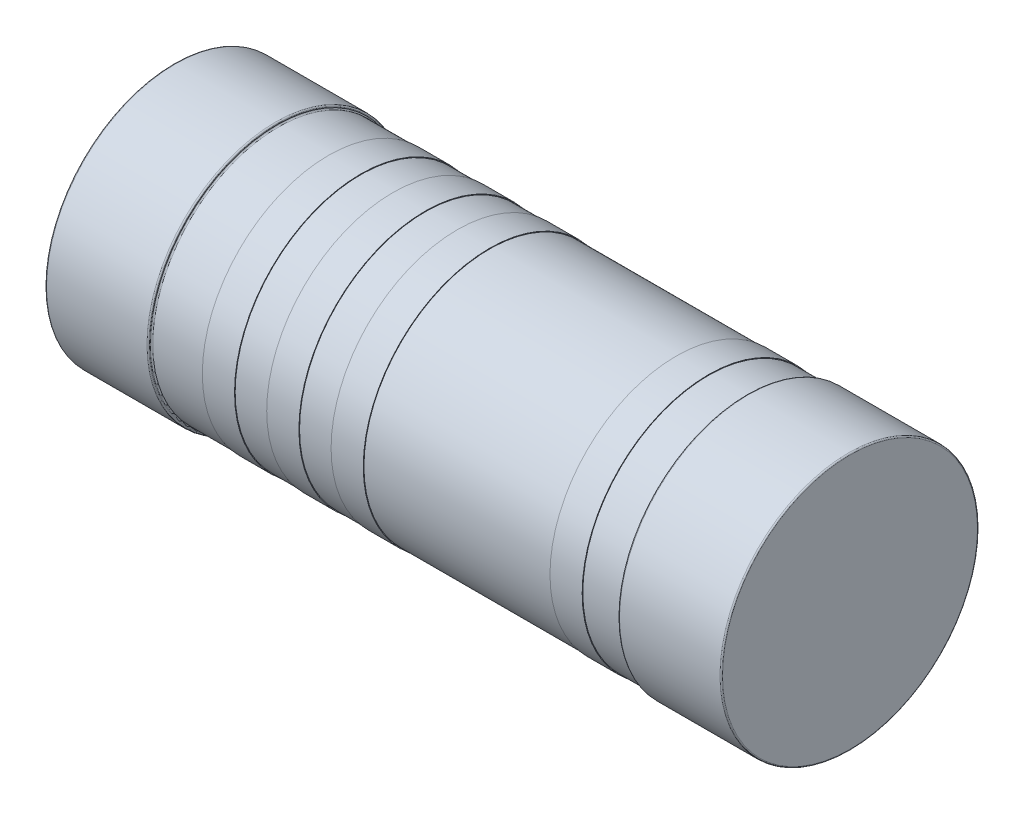
ISO-10303-21;
HEADER;
FILE_DESCRIPTION(('STEP AP214'),'2;1');
FILE_NAME('part.step','',(''),(''),'','','');
FILE_SCHEMA(('AUTOMOTIVE_DESIGN { 1 0 10303 214 1 1 1 1 }'));
ENDSEC;
DATA;
#1=APPLICATION_CONTEXT('core data for automotive mechanical design processes');
#2=APPLICATION_PROTOCOL_DEFINITION('international standard','automotive_design',2000,#1);
#3=PRODUCT_CONTEXT('',#1,'mechanical');
#4=PRODUCT('Part','Part','',(#3));
#5=PRODUCT_RELATED_PRODUCT_CATEGORY('part','',(#4));
#6=PRODUCT_DEFINITION_FORMATION('','',#4);
#7=PRODUCT_DEFINITION_CONTEXT('part definition',#1,'design');
#8=PRODUCT_DEFINITION('design','',#6,#7);
#9=PRODUCT_DEFINITION_SHAPE('','',#8);
#10=(LENGTH_UNIT() NAMED_UNIT(*) SI_UNIT(.MILLI.,.METRE.));
#11=(NAMED_UNIT(*) PLANE_ANGLE_UNIT() SI_UNIT($,.RADIAN.));
#12=(NAMED_UNIT(*) SI_UNIT($,.STERADIAN.) SOLID_ANGLE_UNIT());
#13=UNCERTAINTY_MEASURE_WITH_UNIT(LENGTH_MEASURE(1.E-05),#10,'distance_accuracy_value','');
#14=(GEOMETRIC_REPRESENTATION_CONTEXT(3) GLOBAL_UNCERTAINTY_ASSIGNED_CONTEXT((#13)) GLOBAL_UNIT_ASSIGNED_CONTEXT((#10,
#11,#12)) REPRESENTATION_CONTEXT('',''));
#15=CARTESIAN_POINT('',(0.,0.,0.));
#16=DIRECTION('',(0.,0.,1.));
#17=DIRECTION('',(1.,0.,0.));
#18=AXIS2_PLACEMENT_3D('',#15,#16,#17);
#19=CARTESIAN_POINT('',(-5.25,0.0200000000000001,0.));
#20=DIRECTION('',(-1.,0.,0.));
#21=DIRECTION('',(0.,0.,1.));
#22=AXIS2_PLACEMENT_3D('',#19,#20,#21);
#23=PLANE('',#22);
#24=CARTESIAN_POINT('',(-5.25,2.,0.));
#25=DIRECTION('',(-1.,0.,0.));
#26=DIRECTION('',(0.,0.,1.));
#27=AXIS2_PLACEMENT_3D('',#24,#25,#26);
#28=CIRCLE('',#27,1.98);
#29=CARTESIAN_POINT('',(-5.25,2.,1.98));
#30=VERTEX_POINT('',#29);
#31=EDGE_CURVE('E121',#30,#30,#28,.T.);
#32=ORIENTED_EDGE('',*,*,#31,.T.);
#33=EDGE_LOOP('',(#32));
#34=FACE_BOUND('',#33,.T.);
#35=ADVANCED_FACE('F33',(#34),#23,.T.);
#36=CARTESIAN_POINT('',(5.25,2.,0.));
#37=DIRECTION('',(1.,0.,0.));
#38=DIRECTION('',(0.,0.,-1.));
#39=AXIS2_PLACEMENT_3D('',#36,#37,#38);
#40=PLANE('',#39);
#41=CARTESIAN_POINT('',(5.25,2.,0.));
#42=DIRECTION('',(-1.,0.,0.));
#43=DIRECTION('',(0.,0.,1.));
#44=AXIS2_PLACEMENT_3D('',#41,#42,#43);
#45=CIRCLE('',#44,1.98);
#46=CARTESIAN_POINT('',(5.25,2.,1.98));
#47=VERTEX_POINT('',#46);
#48=EDGE_CURVE('E10',#47,#47,#45,.T.);
#49=ORIENTED_EDGE('',*,*,#48,.F.);
#50=EDGE_LOOP('',(#49));
#51=FACE_BOUND('',#50,.T.);
#52=ADVANCED_FACE('F138',(#51),#40,.T.);
#53=CARTESIAN_POINT('',(5.23,2.,0.));
#54=DIRECTION('',(-1.,0.,0.));
#55=DIRECTION('',(0.,0.,1.));
#56=AXIS2_PLACEMENT_3D('',#53,#54,#55);
#57=TOROIDAL_SURFACE('',#56,1.98,0.0200000000000005);
#58=ORIENTED_EDGE('',*,*,#48,.T.);
#59=EDGE_LOOP('',(#58));
#60=FACE_BOUND('',#59,.T.);
#61=CARTESIAN_POINT('',(5.23,2.,0.));
#62=DIRECTION('',(-1.,0.,0.));
#63=DIRECTION('',(0.,0.,1.));
#64=AXIS2_PLACEMENT_3D('',#61,#62,#63);
#65=CIRCLE('',#64,2.);
#66=CARTESIAN_POINT('',(5.23,2.,2.));
#67=VERTEX_POINT('',#66);
#68=EDGE_CURVE('E39',#67,#67,#65,.T.);
#69=ORIENTED_EDGE('',*,*,#68,.F.);
#70=EDGE_LOOP('',(#69));
#71=FACE_BOUND('',#70,.T.);
#72=ADVANCED_FACE('F142',(#60,#71),#57,.T.);
#73=CARTESIAN_POINT('',(-5.25,2.,0.));
#74=DIRECTION('',(-1.,0.,0.));
#75=DIRECTION('',(0.,0.,1.));
#76=AXIS2_PLACEMENT_3D('',#73,#74,#75);
#77=CYLINDRICAL_SURFACE('',#76,2.);
#78=ORIENTED_EDGE('',*,*,#68,.T.);
#79=EDGE_LOOP('',(#78));
#80=FACE_BOUND('',#79,.T.);
#81=CARTESIAN_POINT('',(3.67,2.,0.));
#82=DIRECTION('',(-1.,0.,0.));
#83=DIRECTION('',(0.,0.,1.));
#84=AXIS2_PLACEMENT_3D('',#81,#82,#83);
#85=CIRCLE('',#84,2.);
#86=CARTESIAN_POINT('',(3.67,2.,2.));
#87=VERTEX_POINT('',#86);
#88=EDGE_CURVE('E43',#87,#87,#85,.T.);
#89=ORIENTED_EDGE('',*,*,#88,.F.);
#90=EDGE_LOOP('',(#89));
#91=FACE_BOUND('',#90,.T.);
#92=ADVANCED_FACE('F147',(#80,#91),#77,.T.);
#93=CARTESIAN_POINT('',(3.67,2.,0.));
#94=DIRECTION('',(-1.,0.,0.));
#95=DIRECTION('',(0.,0.,1.));
#96=AXIS2_PLACEMENT_3D('',#93,#94,#95);
#97=TOROIDAL_SURFACE('',#96,1.98,0.02);
#98=ORIENTED_EDGE('',*,*,#88,.T.);
#99=EDGE_LOOP('',(#98));
#100=FACE_BOUND('',#99,.T.);
#101=CARTESIAN_POINT('',(3.65,2.,0.));
#102=DIRECTION('',(-1.,0.,0.));
#103=DIRECTION('',(0.,0.,1.));
#104=AXIS2_PLACEMENT_3D('',#101,#102,#103);
#105=CIRCLE('',#104,1.98);
#106=CARTESIAN_POINT('',(3.65,2.,1.98));
#107=VERTEX_POINT('',#106);
#108=EDGE_CURVE('E47',#107,#107,#105,.T.);
#109=ORIENTED_EDGE('',*,*,#108,.F.);
#110=EDGE_LOOP('',(#109));
#111=FACE_BOUND('',#110,.T.);
#112=ADVANCED_FACE('F152',(#100,#111),#97,.T.);
#113=CARTESIAN_POINT('',(3.65,0.03,0.));
#114=DIRECTION('',(-1.,0.,0.));
#115=DIRECTION('',(0.,0.,1.));
#116=AXIS2_PLACEMENT_3D('',#113,#114,#115);
#117=PLANE('',#116);
#118=ORIENTED_EDGE('',*,*,#108,.T.);
#119=EDGE_LOOP('',(#118));
#120=FACE_BOUND('',#119,.T.);
#121=CARTESIAN_POINT('',(3.65,2.,0.));
#122=DIRECTION('',(-1.,0.,0.));
#123=DIRECTION('',(0.,0.,1.));
#124=AXIS2_PLACEMENT_3D('',#121,#122,#123);
#125=CIRCLE('',#124,1.97);
#126=CARTESIAN_POINT('',(3.65,2.,1.97));
#127=VERTEX_POINT('',#126);
#128=EDGE_CURVE('E52',#127,#127,#125,.T.);
#129=ORIENTED_EDGE('',*,*,#128,.F.);
#130=EDGE_LOOP('',(#129));
#131=FACE_BOUND('',#130,.T.);
#132=ADVANCED_FACE('F155',(#120,#131),#117,.T.);
#133=CARTESIAN_POINT('',(3.63,2.,0.));
#134=DIRECTION('',(-1.,0.,0.));
#135=DIRECTION('',(0.,0.,1.));
#136=AXIS2_PLACEMENT_3D('',#133,#134,#135);
#137=TOROIDAL_SURFACE('',#136,1.97,0.02);
#138=ORIENTED_EDGE('',*,*,#128,.T.);
#139=EDGE_LOOP('',(#138));
#140=FACE_BOUND('',#139,.T.);
#141=CARTESIAN_POINT('',(3.63,2.,0.));
#142=DIRECTION('',(-1.,0.,0.));
#143=DIRECTION('',(0.,0.,1.));
#144=AXIS2_PLACEMENT_3D('',#141,#142,#143);
#145=CIRCLE('',#144,1.95);
#146=CARTESIAN_POINT('',(3.63,2.,1.95));
#147=VERTEX_POINT('',#146);
#148=EDGE_CURVE('E55',#147,#147,#145,.T.);
#149=ORIENTED_EDGE('',*,*,#148,.F.);
#150=EDGE_LOOP('',(#149));
#151=FACE_BOUND('',#150,.T.);
#152=ADVANCED_FACE('F159',(#140,#151),#137,.F.);
#153=CARTESIAN_POINT('',(-5.25,2.,0.));
#154=DIRECTION('',(-1.,0.,0.));
#155=DIRECTION('',(0.,0.,1.));
#156=AXIS2_PLACEMENT_3D('',#153,#154,#155);
#157=CYLINDRICAL_SURFACE('',#156,1.95);
#158=ORIENTED_EDGE('',*,*,#148,.T.);
#159=EDGE_LOOP('',(#158));
#160=FACE_BOUND('',#159,.T.);
#161=CARTESIAN_POINT('',(3.05,2.,0.));
#162=DIRECTION('',(-1.,0.,0.));
#163=DIRECTION('',(0.,0.,1.));
#164=AXIS2_PLACEMENT_3D('',#161,#162,#163);
#165=CIRCLE('',#164,1.95);
#166=CARTESIAN_POINT('',(3.05,2.,1.95));
#167=VERTEX_POINT('',#166);
#168=EDGE_CURVE('E58',#167,#167,#165,.T.);
#169=ORIENTED_EDGE('',*,*,#168,.F.);
#170=EDGE_LOOP('',(#169));
#171=FACE_BOUND('',#170,.T.);
#172=ADVANCED_FACE('F163',(#160,#171),#157,.T.);
#173=CARTESIAN_POINT('',(3.05,0.05,0.));
#174=DIRECTION('',(1.,0.,0.));
#175=DIRECTION('',(0.,0.,-1.));
#176=AXIS2_PLACEMENT_3D('',#173,#174,#175);
#177=PLANE('',#176);
#178=ORIENTED_EDGE('',*,*,#168,.T.);
#179=EDGE_LOOP('',(#178));
#180=FACE_BOUND('',#179,.T.);
#181=CARTESIAN_POINT('',(3.05,2.,0.));
#182=DIRECTION('',(-1.,0.,0.));
#183=DIRECTION('',(0.,0.,1.));
#184=AXIS2_PLACEMENT_3D('',#181,#182,#183);
#185=CIRCLE('',#184,1.96);
#186=CARTESIAN_POINT('',(3.05,2.,1.96));
#187=VERTEX_POINT('',#186);
#188=EDGE_CURVE('E61',#187,#187,#185,.T.);
#189=ORIENTED_EDGE('',*,*,#188,.F.);
#190=EDGE_LOOP('',(#189));
#191=FACE_BOUND('',#190,.T.);
#192=ADVANCED_FACE('F167',(#180,#191),#177,.T.);
#193=CARTESIAN_POINT('',(-5.25,2.,0.));
#194=DIRECTION('',(-1.,0.,0.));
#195=DIRECTION('',(0.,0.,1.));
#196=AXIS2_PLACEMENT_3D('',#193,#194,#195);
#197=CYLINDRICAL_SURFACE('',#196,1.96);
#198=ORIENTED_EDGE('',*,*,#188,.T.);
#199=EDGE_LOOP('',(#198));
#200=FACE_BOUND('',#199,.T.);
#201=CARTESIAN_POINT('',(2.55,2.,0.));
#202=DIRECTION('',(-1.,0.,0.));
#203=DIRECTION('',(0.,0.,1.));
#204=AXIS2_PLACEMENT_3D('',#201,#202,#203);
#205=CIRCLE('',#204,1.96);
#206=CARTESIAN_POINT('',(2.55,2.,1.96));
#207=VERTEX_POINT('',#206);
#208=EDGE_CURVE('E64',#207,#207,#205,.T.);
#209=ORIENTED_EDGE('',*,*,#208,.F.);
#210=EDGE_LOOP('',(#209));
#211=FACE_BOUND('',#210,.T.);
#212=ADVANCED_FACE('F171',(#200,#211),#197,.T.);
#213=CARTESIAN_POINT('',(2.55,0.0400000000000004,0.));
#214=DIRECTION('',(-1.,0.,0.));
#215=DIRECTION('',(0.,0.,1.));
#216=AXIS2_PLACEMENT_3D('',#213,#214,#215);
#217=PLANE('',#216);
#218=ORIENTED_EDGE('',*,*,#208,.T.);
#219=EDGE_LOOP('',(#218));
#220=FACE_BOUND('',#219,.T.);
#221=CARTESIAN_POINT('',(2.55,2.,0.));
#222=DIRECTION('',(-1.,0.,0.));
#223=DIRECTION('',(0.,0.,1.));
#224=AXIS2_PLACEMENT_3D('',#221,#222,#223);
#225=CIRCLE('',#224,1.95);
#226=CARTESIAN_POINT('',(2.55,2.,1.95));
#227=VERTEX_POINT('',#226);
#228=EDGE_CURVE('E67',#227,#227,#225,.T.);
#229=ORIENTED_EDGE('',*,*,#228,.F.);
#230=EDGE_LOOP('',(#229));
#231=FACE_BOUND('',#230,.T.);
#232=ADVANCED_FACE('F175',(#220,#231),#217,.T.);
#233=CARTESIAN_POINT('',(-5.25,2.,0.));
#234=DIRECTION('',(-1.,0.,0.));
#235=DIRECTION('',(0.,0.,1.));
#236=AXIS2_PLACEMENT_3D('',#233,#234,#235);
#237=CYLINDRICAL_SURFACE('',#236,1.95);
#238=ORIENTED_EDGE('',*,*,#228,.T.);
#239=EDGE_LOOP('',(#238));
#240=FACE_BOUND('',#239,.T.);
#241=CARTESIAN_POINT('',(-0.35,2.,0.));
#242=DIRECTION('',(-1.,0.,0.));
#243=DIRECTION('',(0.,0.,1.));
#244=AXIS2_PLACEMENT_3D('',#241,#242,#243);
#245=CIRCLE('',#244,1.95);
#246=CARTESIAN_POINT('',(-0.35,2.,1.95));
#247=VERTEX_POINT('',#246);
#248=EDGE_CURVE('E70',#247,#247,#245,.T.);
#249=ORIENTED_EDGE('',*,*,#248,.F.);
#250=EDGE_LOOP('',(#249));
#251=FACE_BOUND('',#250,.T.);
#252=ADVANCED_FACE('F179',(#240,#251),#237,.T.);
#253=CARTESIAN_POINT('',(-0.35,0.04,0.));
#254=DIRECTION('',(1.,0.,0.));
#255=DIRECTION('',(0.,0.,-1.));
#256=AXIS2_PLACEMENT_3D('',#253,#254,#255);
#257=PLANE('',#256);
#258=ORIENTED_EDGE('',*,*,#248,.T.);
#259=EDGE_LOOP('',(#258));
#260=FACE_BOUND('',#259,.T.);
#261=CARTESIAN_POINT('',(-0.35,2.,0.));
#262=DIRECTION('',(-1.,0.,0.));
#263=DIRECTION('',(0.,0.,1.));
#264=AXIS2_PLACEMENT_3D('',#261,#262,#263);
#265=CIRCLE('',#264,1.96);
#266=CARTESIAN_POINT('',(-0.35,2.,1.96));
#267=VERTEX_POINT('',#266);
#268=EDGE_CURVE('E73',#267,#267,#265,.T.);
#269=ORIENTED_EDGE('',*,*,#268,.F.);
#270=EDGE_LOOP('',(#269));
#271=FACE_BOUND('',#270,.T.);
#272=ADVANCED_FACE('F183',(#260,#271),#257,.T.);
#273=CARTESIAN_POINT('',(-5.25,2.,0.));
#274=DIRECTION('',(-1.,0.,0.));
#275=DIRECTION('',(0.,0.,1.));
#276=AXIS2_PLACEMENT_3D('',#273,#274,#275);
#277=CYLINDRICAL_SURFACE('',#276,1.96);
#278=ORIENTED_EDGE('',*,*,#268,.T.);
#279=EDGE_LOOP('',(#278));
#280=FACE_BOUND('',#279,.T.);
#281=CARTESIAN_POINT('',(-0.85,2.,0.));
#282=DIRECTION('',(-1.,0.,0.));
#283=DIRECTION('',(0.,0.,1.));
#284=AXIS2_PLACEMENT_3D('',#281,#282,#283);
#285=CIRCLE('',#284,1.96);
#286=CARTESIAN_POINT('',(-0.85,2.,1.96));
#287=VERTEX_POINT('',#286);
#288=EDGE_CURVE('E76',#287,#287,#285,.T.);
#289=ORIENTED_EDGE('',*,*,#288,.F.);
#290=EDGE_LOOP('',(#289));
#291=FACE_BOUND('',#290,.T.);
#292=ADVANCED_FACE('F187',(#280,#291),#277,.T.);
#293=CARTESIAN_POINT('',(-0.85,0.04,0.));
#294=DIRECTION('',(-1.,0.,0.));
#295=DIRECTION('',(0.,0.,1.));
#296=AXIS2_PLACEMENT_3D('',#293,#294,#295);
#297=PLANE('',#296);
#298=ORIENTED_EDGE('',*,*,#288,.T.);
#299=EDGE_LOOP('',(#298));
#300=FACE_BOUND('',#299,.T.);
#301=CARTESIAN_POINT('',(-0.85,2.,0.));
#302=DIRECTION('',(-1.,0.,0.));
#303=DIRECTION('',(0.,0.,1.));
#304=AXIS2_PLACEMENT_3D('',#301,#302,#303);
#305=CIRCLE('',#304,1.95);
#306=CARTESIAN_POINT('',(-0.85,2.,1.95));
#307=VERTEX_POINT('',#306);
#308=EDGE_CURVE('E79',#307,#307,#305,.T.);
#309=ORIENTED_EDGE('',*,*,#308,.F.);
#310=EDGE_LOOP('',(#309));
#311=FACE_BOUND('',#310,.T.);
#312=ADVANCED_FACE('F191',(#300,#311),#297,.T.);
#313=CARTESIAN_POINT('',(-5.25,2.,0.));
#314=DIRECTION('',(-1.,0.,0.));
#315=DIRECTION('',(0.,0.,1.));
#316=AXIS2_PLACEMENT_3D('',#313,#314,#315);
#317=CYLINDRICAL_SURFACE('',#316,1.95);
#318=ORIENTED_EDGE('',*,*,#308,.T.);
#319=EDGE_LOOP('',(#318));
#320=FACE_BOUND('',#319,.T.);
#321=CARTESIAN_POINT('',(-1.35,2.,0.));
#322=DIRECTION('',(-1.,0.,0.));
#323=DIRECTION('',(0.,0.,1.));
#324=AXIS2_PLACEMENT_3D('',#321,#322,#323);
#325=CIRCLE('',#324,1.95);
#326=CARTESIAN_POINT('',(-1.35,2.,1.95));
#327=VERTEX_POINT('',#326);
#328=EDGE_CURVE('E82',#327,#327,#325,.T.);
#329=ORIENTED_EDGE('',*,*,#328,.F.);
#330=EDGE_LOOP('',(#329));
#331=FACE_BOUND('',#330,.T.);
#332=ADVANCED_FACE('F195',(#320,#331),#317,.T.);
#333=CARTESIAN_POINT('',(-1.35,0.0400000000000001,0.));
#334=DIRECTION('',(1.,0.,0.));
#335=DIRECTION('',(0.,0.,-1.));
#336=AXIS2_PLACEMENT_3D('',#333,#334,#335);
#337=PLANE('',#336);
#338=ORIENTED_EDGE('',*,*,#328,.T.);
#339=EDGE_LOOP('',(#338));
#340=FACE_BOUND('',#339,.T.);
#341=CARTESIAN_POINT('',(-1.35,2.,0.));
#342=DIRECTION('',(-1.,0.,0.));
#343=DIRECTION('',(0.,0.,1.));
#344=AXIS2_PLACEMENT_3D('',#341,#342,#343);
#345=CIRCLE('',#344,1.96);
#346=CARTESIAN_POINT('',(-1.35,2.,1.96));
#347=VERTEX_POINT('',#346);
#348=EDGE_CURVE('E85',#347,#347,#345,.T.);
#349=ORIENTED_EDGE('',*,*,#348,.F.);
#350=EDGE_LOOP('',(#349));
#351=FACE_BOUND('',#350,.T.);
#352=ADVANCED_FACE('F199',(#340,#351),#337,.T.);
#353=CARTESIAN_POINT('',(-5.25,2.,0.));
#354=DIRECTION('',(-1.,0.,0.));
#355=DIRECTION('',(0.,0.,1.));
#356=AXIS2_PLACEMENT_3D('',#353,#354,#355);
#357=CYLINDRICAL_SURFACE('',#356,1.96);
#358=ORIENTED_EDGE('',*,*,#348,.T.);
#359=EDGE_LOOP('',(#358));
#360=FACE_BOUND('',#359,.T.);
#361=CARTESIAN_POINT('',(-1.85,2.,0.));
#362=DIRECTION('',(-1.,0.,0.));
#363=DIRECTION('',(0.,0.,1.));
#364=AXIS2_PLACEMENT_3D('',#361,#362,#363);
#365=CIRCLE('',#364,1.96);
#366=CARTESIAN_POINT('',(-1.85,2.,1.96));
#367=VERTEX_POINT('',#366);
#368=EDGE_CURVE('E88',#367,#367,#365,.T.);
#369=ORIENTED_EDGE('',*,*,#368,.F.);
#370=EDGE_LOOP('',(#369));
#371=FACE_BOUND('',#370,.T.);
#372=ADVANCED_FACE('F203',(#360,#371),#357,.T.);
#373=CARTESIAN_POINT('',(-1.85,0.05,0.));
#374=DIRECTION('',(-1.,0.,0.));
#375=DIRECTION('',(0.,0.,1.));
#376=AXIS2_PLACEMENT_3D('',#373,#374,#375);
#377=PLANE('',#376);
#378=ORIENTED_EDGE('',*,*,#368,.T.);
#379=EDGE_LOOP('',(#378));
#380=FACE_BOUND('',#379,.T.);
#381=CARTESIAN_POINT('',(-1.85,2.,0.));
#382=DIRECTION('',(-1.,0.,0.));
#383=DIRECTION('',(0.,0.,1.));
#384=AXIS2_PLACEMENT_3D('',#381,#382,#383);
#385=CIRCLE('',#384,1.95);
#386=CARTESIAN_POINT('',(-1.85,2.,1.95));
#387=VERTEX_POINT('',#386);
#388=EDGE_CURVE('E91',#387,#387,#385,.T.);
#389=ORIENTED_EDGE('',*,*,#388,.F.);
#390=EDGE_LOOP('',(#389));
#391=FACE_BOUND('',#390,.T.);
#392=ADVANCED_FACE('F207',(#380,#391),#377,.T.);
#393=CARTESIAN_POINT('',(-5.25,2.,0.));
#394=DIRECTION('',(-1.,0.,0.));
#395=DIRECTION('',(0.,0.,1.));
#396=AXIS2_PLACEMENT_3D('',#393,#394,#395);
#397=CYLINDRICAL_SURFACE('',#396,1.95);
#398=ORIENTED_EDGE('',*,*,#388,.T.);
#399=EDGE_LOOP('',(#398));
#400=FACE_BOUND('',#399,.T.);
#401=CARTESIAN_POINT('',(-2.35,2.,0.));
#402=DIRECTION('',(-1.,0.,0.));
#403=DIRECTION('',(0.,0.,1.));
#404=AXIS2_PLACEMENT_3D('',#401,#402,#403);
#405=CIRCLE('',#404,1.95);
#406=CARTESIAN_POINT('',(-2.35,2.,1.95));
#407=VERTEX_POINT('',#406);
#408=EDGE_CURVE('E94',#407,#407,#405,.T.);
#409=ORIENTED_EDGE('',*,*,#408,.F.);
#410=EDGE_LOOP('',(#409));
#411=FACE_BOUND('',#410,.T.);
#412=ADVANCED_FACE('F211',(#400,#411),#397,.T.);
#413=CARTESIAN_POINT('',(-2.35,0.0400000000000001,0.));
#414=DIRECTION('',(1.,0.,0.));
#415=DIRECTION('',(0.,0.,-1.));
#416=AXIS2_PLACEMENT_3D('',#413,#414,#415);
#417=PLANE('',#416);
#418=ORIENTED_EDGE('',*,*,#408,.T.);
#419=EDGE_LOOP('',(#418));
#420=FACE_BOUND('',#419,.T.);
#421=CARTESIAN_POINT('',(-2.35,2.,0.));
#422=DIRECTION('',(-1.,0.,0.));
#423=DIRECTION('',(0.,0.,1.));
#424=AXIS2_PLACEMENT_3D('',#421,#422,#423);
#425=CIRCLE('',#424,1.96);
#426=CARTESIAN_POINT('',(-2.35,2.,1.96));
#427=VERTEX_POINT('',#426);
#428=EDGE_CURVE('E97',#427,#427,#425,.T.);
#429=ORIENTED_EDGE('',*,*,#428,.F.);
#430=EDGE_LOOP('',(#429));
#431=FACE_BOUND('',#430,.T.);
#432=ADVANCED_FACE('F215',(#420,#431),#417,.T.);
#433=CARTESIAN_POINT('',(-5.25,2.,0.));
#434=DIRECTION('',(-1.,0.,0.));
#435=DIRECTION('',(0.,0.,1.));
#436=AXIS2_PLACEMENT_3D('',#433,#434,#435);
#437=CYLINDRICAL_SURFACE('',#436,1.96);
#438=ORIENTED_EDGE('',*,*,#428,.T.);
#439=EDGE_LOOP('',(#438));
#440=FACE_BOUND('',#439,.T.);
#441=CARTESIAN_POINT('',(-2.85,2.,0.));
#442=DIRECTION('',(-1.,0.,0.));
#443=DIRECTION('',(0.,0.,1.));
#444=AXIS2_PLACEMENT_3D('',#441,#442,#443);
#445=CIRCLE('',#444,1.96);
#446=CARTESIAN_POINT('',(-2.85,2.,1.96));
#447=VERTEX_POINT('',#446);
#448=EDGE_CURVE('E100',#447,#447,#445,.T.);
#449=ORIENTED_EDGE('',*,*,#448,.F.);
#450=EDGE_LOOP('',(#449));
#451=FACE_BOUND('',#450,.T.);
#452=ADVANCED_FACE('F219',(#440,#451),#437,.T.);
#453=CARTESIAN_POINT('',(-2.85,0.05,0.));
#454=DIRECTION('',(-1.,0.,0.));
#455=DIRECTION('',(0.,0.,1.));
#456=AXIS2_PLACEMENT_3D('',#453,#454,#455);
#457=PLANE('',#456);
#458=ORIENTED_EDGE('',*,*,#448,.T.);
#459=EDGE_LOOP('',(#458));
#460=FACE_BOUND('',#459,.T.);
#461=CARTESIAN_POINT('',(-2.85,2.,0.));
#462=DIRECTION('',(-1.,0.,0.));
#463=DIRECTION('',(0.,0.,1.));
#464=AXIS2_PLACEMENT_3D('',#461,#462,#463);
#465=CIRCLE('',#464,1.95);
#466=CARTESIAN_POINT('',(-2.85,2.,1.95));
#467=VERTEX_POINT('',#466);
#468=EDGE_CURVE('E103',#467,#467,#465,.T.);
#469=ORIENTED_EDGE('',*,*,#468,.F.);
#470=EDGE_LOOP('',(#469));
#471=FACE_BOUND('',#470,.T.);
#472=ADVANCED_FACE('F223',(#460,#471),#457,.T.);
#473=CARTESIAN_POINT('',(-5.25,2.,0.));
#474=DIRECTION('',(-1.,0.,0.));
#475=DIRECTION('',(0.,0.,1.));
#476=AXIS2_PLACEMENT_3D('',#473,#474,#475);
#477=CYLINDRICAL_SURFACE('',#476,1.95);
#478=ORIENTED_EDGE('',*,*,#468,.T.);
#479=EDGE_LOOP('',(#478));
#480=FACE_BOUND('',#479,.T.);
#481=CARTESIAN_POINT('',(-3.63,2.,0.));
#482=DIRECTION('',(-1.,0.,0.));
#483=DIRECTION('',(0.,0.,1.));
#484=AXIS2_PLACEMENT_3D('',#481,#482,#483);
#485=CIRCLE('',#484,1.95);
#486=CARTESIAN_POINT('',(-3.63,2.,1.95));
#487=VERTEX_POINT('',#486);
#488=EDGE_CURVE('E106',#487,#487,#485,.T.);
#489=ORIENTED_EDGE('',*,*,#488,.F.);
#490=EDGE_LOOP('',(#489));
#491=FACE_BOUND('',#490,.T.);
#492=ADVANCED_FACE('F227',(#480,#491),#477,.T.);
#493=CARTESIAN_POINT('',(-3.63,2.,0.));
#494=DIRECTION('',(-1.,0.,0.));
#495=DIRECTION('',(0.,0.,1.));
#496=AXIS2_PLACEMENT_3D('',#493,#494,#495);
#497=TOROIDAL_SURFACE('',#496,1.97,0.02);
#498=ORIENTED_EDGE('',*,*,#488,.T.);
#499=EDGE_LOOP('',(#498));
#500=FACE_BOUND('',#499,.T.);
#501=CARTESIAN_POINT('',(-3.65,2.,0.));
#502=DIRECTION('',(-1.,0.,0.));
#503=DIRECTION('',(0.,0.,1.));
#504=AXIS2_PLACEMENT_3D('',#501,#502,#503);
#505=CIRCLE('',#504,1.97);
#506=CARTESIAN_POINT('',(-3.65,2.,1.97));
#507=VERTEX_POINT('',#506);
#508=EDGE_CURVE('E109',#507,#507,#505,.T.);
#509=ORIENTED_EDGE('',*,*,#508,.F.);
#510=EDGE_LOOP('',(#509));
#511=FACE_BOUND('',#510,.T.);
#512=ADVANCED_FACE('F231',(#500,#511),#497,.F.);
#513=CARTESIAN_POINT('',(-3.65,0.02,0.));
#514=DIRECTION('',(1.,0.,0.));
#515=DIRECTION('',(0.,0.,-1.));
#516=AXIS2_PLACEMENT_3D('',#513,#514,#515);
#517=PLANE('',#516);
#518=ORIENTED_EDGE('',*,*,#508,.T.);
#519=EDGE_LOOP('',(#518));
#520=FACE_BOUND('',#519,.T.);
#521=CARTESIAN_POINT('',(-3.65,2.,0.));
#522=DIRECTION('',(-1.,0.,0.));
#523=DIRECTION('',(0.,0.,1.));
#524=AXIS2_PLACEMENT_3D('',#521,#522,#523);
#525=CIRCLE('',#524,1.98);
#526=CARTESIAN_POINT('',(-3.65,2.,1.98));
#527=VERTEX_POINT('',#526);
#528=EDGE_CURVE('E112',#527,#527,#525,.T.);
#529=ORIENTED_EDGE('',*,*,#528,.F.);
#530=EDGE_LOOP('',(#529));
#531=FACE_BOUND('',#530,.T.);
#532=ADVANCED_FACE('F235',(#520,#531),#517,.T.);
#533=CARTESIAN_POINT('',(-3.67,2.,0.));
#534=DIRECTION('',(-1.,0.,0.));
#535=DIRECTION('',(0.,0.,1.));
#536=AXIS2_PLACEMENT_3D('',#533,#534,#535);
#537=TOROIDAL_SURFACE('',#536,1.98,0.02);
#538=ORIENTED_EDGE('',*,*,#528,.T.);
#539=EDGE_LOOP('',(#538));
#540=FACE_BOUND('',#539,.T.);
#541=CARTESIAN_POINT('',(-3.67,2.,0.));
#542=DIRECTION('',(-1.,0.,0.));
#543=DIRECTION('',(0.,0.,1.));
#544=AXIS2_PLACEMENT_3D('',#541,#542,#543);
#545=CIRCLE('',#544,2.);
#546=CARTESIAN_POINT('',(-3.67,2.,2.));
#547=VERTEX_POINT('',#546);
#548=EDGE_CURVE('E115',#547,#547,#545,.T.);
#549=ORIENTED_EDGE('',*,*,#548,.F.);
#550=EDGE_LOOP('',(#549));
#551=FACE_BOUND('',#550,.T.);
#552=ADVANCED_FACE('F134',(#540,#551),#537,.T.);
#553=CARTESIAN_POINT('',(-5.25,2.,0.));
#554=DIRECTION('',(-1.,0.,0.));
#555=DIRECTION('',(0.,0.,1.));
#556=AXIS2_PLACEMENT_3D('',#553,#554,#555);
#557=CYLINDRICAL_SURFACE('',#556,2.);
#558=ORIENTED_EDGE('',*,*,#548,.T.);
#559=EDGE_LOOP('',(#558));
#560=FACE_BOUND('',#559,.T.);
#561=CARTESIAN_POINT('',(-5.23,2.,0.));
#562=DIRECTION('',(-1.,0.,0.));
#563=DIRECTION('',(0.,0.,1.));
#564=AXIS2_PLACEMENT_3D('',#561,#562,#563);
#565=CIRCLE('',#564,2.);
#566=CARTESIAN_POINT('',(-5.23,2.,2.));
#567=VERTEX_POINT('',#566);
#568=EDGE_CURVE('E118',#567,#567,#565,.T.);
#569=ORIENTED_EDGE('',*,*,#568,.F.);
#570=EDGE_LOOP('',(#569));
#571=FACE_BOUND('',#570,.T.);
#572=ADVANCED_FACE('F128',(#560,#571),#557,.T.);
#573=CARTESIAN_POINT('',(-5.23,2.,0.));
#574=DIRECTION('',(-1.,0.,0.));
#575=DIRECTION('',(0.,0.,1.));
#576=AXIS2_PLACEMENT_3D('',#573,#574,#575);
#577=TOROIDAL_SURFACE('',#576,1.98,0.0200000000000005);
#578=ORIENTED_EDGE('',*,*,#568,.T.);
#579=EDGE_LOOP('',(#578));
#580=FACE_BOUND('',#579,.T.);
#581=ORIENTED_EDGE('',*,*,#31,.F.);
#582=EDGE_LOOP('',(#581));
#583=FACE_BOUND('',#582,.T.);
#584=ADVANCED_FACE('F126',(#580,#583),#577,.T.);
#585=CLOSED_SHELL('',(#35,#52,#72,#92,#112,#132,#152,#172,#192,#212,#232,#252,#272,#292,#312,
#332,#352,#372,#392,#412,#432,#452,#472,#492,#512,#532,#552,#572,#584));
#586=MANIFOLD_SOLID_BREP('B2',#585);
#587=ADVANCED_BREP_SHAPE_REPRESENTATION('',(#18,#586),#14);
#588=SHAPE_DEFINITION_REPRESENTATION(#9,#587);
ENDSEC;
END-ISO-10303-21;
